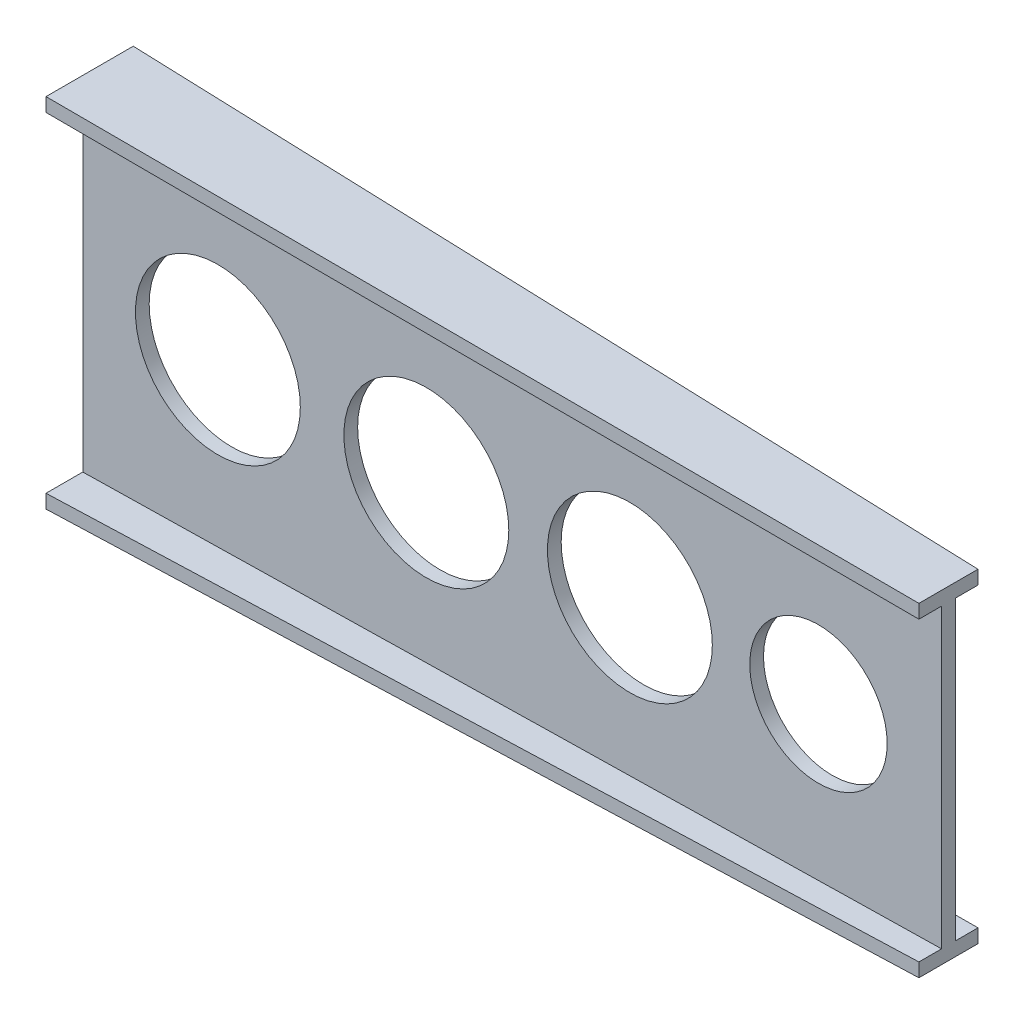
ISO-10303-21;
HEADER;
FILE_DESCRIPTION(('STEP AP214'),'2;1');
FILE_NAME('part.step','',(''),(''),'','','');
FILE_SCHEMA(('AUTOMOTIVE_DESIGN { 1 0 10303 214 1 1 1 1 }'));
ENDSEC;
DATA;
#1=APPLICATION_CONTEXT('core data for automotive mechanical design processes');
#2=APPLICATION_PROTOCOL_DEFINITION('international standard','automotive_design',2000,#1);
#3=PRODUCT_CONTEXT('',#1,'mechanical');
#4=PRODUCT('Part','Part','',(#3));
#5=PRODUCT_RELATED_PRODUCT_CATEGORY('part','',(#4));
#6=PRODUCT_DEFINITION_FORMATION('','',#4);
#7=PRODUCT_DEFINITION_CONTEXT('part definition',#1,'design');
#8=PRODUCT_DEFINITION('design','',#6,#7);
#9=PRODUCT_DEFINITION_SHAPE('','',#8);
#10=(LENGTH_UNIT() NAMED_UNIT(*) SI_UNIT(.MILLI.,.METRE.));
#11=(NAMED_UNIT(*) PLANE_ANGLE_UNIT() SI_UNIT($,.RADIAN.));
#12=(NAMED_UNIT(*) SI_UNIT($,.STERADIAN.) SOLID_ANGLE_UNIT());
#13=UNCERTAINTY_MEASURE_WITH_UNIT(LENGTH_MEASURE(1.E-05),#10,'distance_accuracy_value','');
#14=(GEOMETRIC_REPRESENTATION_CONTEXT(3) GLOBAL_UNCERTAINTY_ASSIGNED_CONTEXT((#13)) GLOBAL_UNIT_ASSIGNED_CONTEXT((#10,
#11,#12)) REPRESENTATION_CONTEXT('',''));
#15=CARTESIAN_POINT('',(0.,0.,0.));
#16=DIRECTION('',(0.,0.,1.));
#17=DIRECTION('',(1.,0.,0.));
#18=AXIS2_PLACEMENT_3D('',#15,#16,#17);
#19=CARTESIAN_POINT('',(1250.,0.,0.));
#20=DIRECTION('',(-1.,0.,0.));
#21=DIRECTION('',(0.,0.,1.));
#22=AXIS2_PLACEMENT_3D('',#19,#20,#21);
#23=PLANE('',#22);
#24=DIRECTION('',(0.,-1.,0.));
#25=VECTOR('',#24,1.);
#26=CARTESIAN_POINT('',(1250.,236.,-32.9999999999997));
#27=LINE('',#26,#25);
#28=CARTESIAN_POINT('',(1250.,236.,-32.9999999999997));
#29=VERTEX_POINT('',#28);
#30=CARTESIAN_POINT('',(1250.,216.,-32.9999999999997));
#31=VERTEX_POINT('',#30);
#32=EDGE_CURVE('E380',#29,#31,#27,.T.);
#33=ORIENTED_EDGE('',*,*,#32,.F.);
#34=DIRECTION('',(0.,0.,-1.));
#35=VECTOR('',#34,1.);
#36=CARTESIAN_POINT('',(1250.,236.,-32.9999999999997));
#37=LINE('',#36,#35);
#38=CARTESIAN_POINT('',(1250.,236.,53.0000000000004));
#39=VERTEX_POINT('',#38);
#40=EDGE_CURVE('E12',#39,#29,#37,.T.);
#41=ORIENTED_EDGE('',*,*,#40,.F.);
#42=DIRECTION('',(0.,1.,0.));
#43=VECTOR('',#42,1.);
#44=CARTESIAN_POINT('',(1250.,236.,53.0000000000004));
#45=LINE('',#44,#43);
#46=CARTESIAN_POINT('',(1250.,216.,53.0000000000004));
#47=VERTEX_POINT('',#46);
#48=EDGE_CURVE('E70',#47,#39,#45,.T.);
#49=ORIENTED_EDGE('',*,*,#48,.F.);
#50=DIRECTION('',(0.,0.,1.));
#51=VECTOR('',#50,1.);
#52=CARTESIAN_POINT('',(1250.,216.,20.0000000000002));
#53=LINE('',#52,#51);
#54=CARTESIAN_POINT('',(1250.,216.,20.0000000000002));
#55=VERTEX_POINT('',#54);
#56=EDGE_CURVE('E658',#55,#47,#53,.T.);
#57=ORIENTED_EDGE('',*,*,#56,.F.);
#58=DIRECTION('',(0.,1.,0.));
#59=VECTOR('',#58,1.);
#60=CARTESIAN_POINT('',(1250.,216.,20.0000000000002));
#61=LINE('',#60,#59);
#62=CARTESIAN_POINT('',(1250.,-216.,20.0000000000002));
#63=VERTEX_POINT('',#62);
#64=EDGE_CURVE('E417',#63,#55,#61,.T.);
#65=ORIENTED_EDGE('',*,*,#64,.F.);
#66=DIRECTION('',(0.,0.,-1.));
#67=VECTOR('',#66,1.);
#68=CARTESIAN_POINT('',(1250.,-216.,20.0000000000002));
#69=LINE('',#68,#67);
#70=CARTESIAN_POINT('',(1250.,-216.,53.0000000000002));
#71=VERTEX_POINT('',#70);
#72=EDGE_CURVE('E431',#71,#63,#69,.T.);
#73=ORIENTED_EDGE('',*,*,#72,.F.);
#74=DIRECTION('',(0.,1.,0.));
#75=VECTOR('',#74,1.);
#76=CARTESIAN_POINT('',(1250.,-216.,53.0000000000002));
#77=LINE('',#76,#75);
#78=CARTESIAN_POINT('',(1250.,-236.,53.0000000000004));
#79=VERTEX_POINT('',#78);
#80=EDGE_CURVE('E445',#79,#71,#77,.T.);
#81=ORIENTED_EDGE('',*,*,#80,.F.);
#82=DIRECTION('',(0.,0.,1.));
#83=VECTOR('',#82,1.);
#84=CARTESIAN_POINT('',(1250.,-236.,-32.9999999999997));
#85=LINE('',#84,#83);
#86=CARTESIAN_POINT('',(1250.,-236.,-32.9999999999997));
#87=VERTEX_POINT('',#86);
#88=EDGE_CURVE('E629',#87,#79,#85,.T.);
#89=ORIENTED_EDGE('',*,*,#88,.F.);
#90=DIRECTION('',(0.,-1.,0.));
#91=VECTOR('',#90,1.);
#92=CARTESIAN_POINT('',(1250.,-216.,-32.9999999999997));
#93=LINE('',#92,#91);
#94=CARTESIAN_POINT('',(1250.,-216.,-32.9999999999997));
#95=VERTEX_POINT('',#94);
#96=EDGE_CURVE('E621',#95,#87,#93,.T.);
#97=ORIENTED_EDGE('',*,*,#96,.F.);
#98=DIRECTION('',(0.,0.,-1.));
#99=VECTOR('',#98,1.);
#100=CARTESIAN_POINT('',(1250.,-216.,-32.9999999999997));
#101=LINE('',#100,#99);
#102=CARTESIAN_POINT('',(1250.,-216.,2.22044604925031E-13));
#103=VERTEX_POINT('',#102);
#104=EDGE_CURVE('E533',#103,#95,#101,.T.);
#105=ORIENTED_EDGE('',*,*,#104,.F.);
#106=DIRECTION('',(0.,-1.,0.));
#107=VECTOR('',#106,1.);
#108=CARTESIAN_POINT('',(1250.,216.,2.22044604925031E-13));
#109=LINE('',#108,#107);
#110=CARTESIAN_POINT('',(1250.,216.,2.22044604925031E-13));
#111=VERTEX_POINT('',#110);
#112=EDGE_CURVE('E84',#111,#103,#109,.T.);
#113=ORIENTED_EDGE('',*,*,#112,.F.);
#114=DIRECTION('',(0.,0.,1.));
#115=VECTOR('',#114,1.);
#116=CARTESIAN_POINT('',(1250.,216.,-32.9999999999997));
#117=LINE('',#116,#115);
#118=EDGE_CURVE('E78',#31,#111,#117,.T.);
#119=ORIENTED_EDGE('',*,*,#118,.F.);
#120=EDGE_LOOP('',(#33,#41,#49,#57,#65,#73,#81,#89,#97,#105,#113,#119));
#121=FACE_BOUND('',#120,.T.);
#122=ADVANCED_FACE('F61',(#121),#23,.F.);
#123=CARTESIAN_POINT('',(0.,0.,0.));
#124=DIRECTION('',(1.,0.,0.));
#125=DIRECTION('',(0.,0.,-1.));
#126=AXIS2_PLACEMENT_3D('',#123,#124,#125);
#127=PLANE('',#126);
#128=DIRECTION('',(0.,-1.,0.));
#129=VECTOR('',#128,1.);
#130=CARTESIAN_POINT('',(0.,260.,73.5000000000003));
#131=LINE('',#130,#129);
#132=CARTESIAN_POINT('',(0.,260.,73.5000000000003));
#133=VERTEX_POINT('',#132);
#134=CARTESIAN_POINT('',(0.,240.,73.5000000000003));
#135=VERTEX_POINT('',#134);
#136=EDGE_CURVE('E159',#133,#135,#131,.T.);
#137=ORIENTED_EDGE('',*,*,#136,.F.);
#138=DIRECTION('',(0.,0.,1.));
#139=VECTOR('',#138,1.);
#140=CARTESIAN_POINT('',(0.,260.,73.5000000000003));
#141=LINE('',#140,#139);
#142=CARTESIAN_POINT('',(0.,260.,-53.4999999999997));
#143=VERTEX_POINT('',#142);
#144=EDGE_CURVE('E168',#143,#133,#141,.T.);
#145=ORIENTED_EDGE('',*,*,#144,.F.);
#146=DIRECTION('',(0.,1.,0.));
#147=VECTOR('',#146,1.);
#148=CARTESIAN_POINT('',(0.,260.,-53.4999999999997));
#149=LINE('',#148,#147);
#150=CARTESIAN_POINT('',(0.,240.,-53.4999999999997));
#151=VERTEX_POINT('',#150);
#152=EDGE_CURVE('E175',#151,#143,#149,.T.);
#153=ORIENTED_EDGE('',*,*,#152,.F.);
#154=DIRECTION('',(0.,0.,-1.));
#155=VECTOR('',#154,1.);
#156=CARTESIAN_POINT('',(0.,240.,2.53624902133429E-13));
#157=LINE('',#156,#155);
#158=CARTESIAN_POINT('',(0.,240.,2.53624902133429E-13));
#159=VERTEX_POINT('',#158);
#160=EDGE_CURVE('E303',#159,#151,#157,.T.);
#161=ORIENTED_EDGE('',*,*,#160,.F.);
#162=DIRECTION('',(0.,1.,0.));
#163=VECTOR('',#162,1.);
#164=CARTESIAN_POINT('',(0.,240.,2.53624902133429E-13));
#165=LINE('',#164,#163);
#166=CARTESIAN_POINT('',(0.,-240.,2.53624902133429E-13));
#167=VERTEX_POINT('',#166);
#168=EDGE_CURVE('E299',#167,#159,#165,.T.);
#169=ORIENTED_EDGE('',*,*,#168,.F.);
#170=DIRECTION('',(0.,0.,1.));
#171=VECTOR('',#170,1.);
#172=CARTESIAN_POINT('',(0.,-240.,2.53624902133429E-13));
#173=LINE('',#172,#171);
#174=CARTESIAN_POINT('',(0.,-240.,-53.4999999999999));
#175=VERTEX_POINT('',#174);
#176=EDGE_CURVE('E295',#175,#167,#173,.T.);
#177=ORIENTED_EDGE('',*,*,#176,.F.);
#178=DIRECTION('',(0.,1.,0.));
#179=VECTOR('',#178,1.);
#180=CARTESIAN_POINT('',(0.,-240.,-53.4999999999999));
#181=LINE('',#180,#179);
#182=CARTESIAN_POINT('',(0.,-260.,-53.4999999999999));
#183=VERTEX_POINT('',#182);
#184=EDGE_CURVE('E291',#183,#175,#181,.T.);
#185=ORIENTED_EDGE('',*,*,#184,.F.);
#186=DIRECTION('',(0.,0.,-1.));
#187=VECTOR('',#186,1.);
#188=CARTESIAN_POINT('',(0.,-260.,73.5000000000001));
#189=LINE('',#188,#187);
#190=CARTESIAN_POINT('',(0.,-260.,73.5000000000001));
#191=VERTEX_POINT('',#190);
#192=EDGE_CURVE('E287',#191,#183,#189,.T.);
#193=ORIENTED_EDGE('',*,*,#192,.F.);
#194=DIRECTION('',(0.,-1.,0.));
#195=VECTOR('',#194,1.);
#196=CARTESIAN_POINT('',(0.,-240.,73.5000000000001));
#197=LINE('',#196,#195);
#198=CARTESIAN_POINT('',(0.,-240.,73.5000000000001));
#199=VERTEX_POINT('',#198);
#200=EDGE_CURVE('E283',#199,#191,#197,.T.);
#201=ORIENTED_EDGE('',*,*,#200,.F.);
#202=DIRECTION('',(0.,0.,1.));
#203=VECTOR('',#202,1.);
#204=CARTESIAN_POINT('',(0.,-240.,73.5000000000001));
#205=LINE('',#204,#203);
#206=CARTESIAN_POINT('',(0.,-240.,20.0000000000003));
#207=VERTEX_POINT('',#206);
#208=EDGE_CURVE('E278',#207,#199,#205,.T.);
#209=ORIENTED_EDGE('',*,*,#208,.F.);
#210=DIRECTION('',(0.,-1.,0.));
#211=VECTOR('',#210,1.);
#212=CARTESIAN_POINT('',(0.,240.,20.0000000000003));
#213=LINE('',#212,#211);
#214=CARTESIAN_POINT('',(0.,240.,20.0000000000003));
#215=VERTEX_POINT('',#214);
#216=EDGE_CURVE('E276',#215,#207,#213,.T.);
#217=ORIENTED_EDGE('',*,*,#216,.F.);
#218=DIRECTION('',(0.,0.,-1.));
#219=VECTOR('',#218,1.);
#220=CARTESIAN_POINT('',(0.,240.,73.5000000000003));
#221=LINE('',#220,#219);
#222=EDGE_CURVE('E182',#135,#215,#221,.T.);
#223=ORIENTED_EDGE('',*,*,#222,.F.);
#224=EDGE_LOOP('',(#137,#145,#153,#161,#169,#177,#185,#193,#201,#209,#217,#223));
#225=FACE_BOUND('',#224,.T.);
#226=ADVANCED_FACE('F180',(#225),#127,.F.);
#227=CARTESIAN_POINT('',(0.,0.,20.0000000000003));
#228=DIRECTION('',(0.,0.,1.));
#229=DIRECTION('',(1.,0.,0.));
#230=AXIS2_PLACEMENT_3D('',#227,#228,#229);
#231=PLANE('',#230);
#232=CARTESIAN_POINT('',(196.664397563097,0.,20.0000000000003));
#233=DIRECTION('',(0.,0.,1.));
#234=DIRECTION('',(1.,0.,0.));
#235=AXIS2_PLACEMENT_3D('',#232,#233,#234);
#236=CIRCLE('',#235,120.);
#237=CARTESIAN_POINT('',(316.664397563097,0.,20.0000000000003));
#238=VERTEX_POINT('',#237);
#239=EDGE_CURVE('E824',#238,#238,#236,.T.);
#240=ORIENTED_EDGE('',*,*,#239,.F.);
#241=EDGE_LOOP('',(#240));
#242=FACE_BOUND('',#241,.T.);
#243=CARTESIAN_POINT('',(500.077852957475,-3.28415443412666,20.0000000000003));
#244=DIRECTION('',(0.,0.,1.));
#245=DIRECTION('',(1.,0.,0.));
#246=AXIS2_PLACEMENT_3D('',#243,#244,#245);
#247=CIRCLE('',#246,120.);
#248=CARTESIAN_POINT('',(620.077852957475,-3.28415443412666,20.0000000000003));
#249=VERTEX_POINT('',#248);
#250=EDGE_CURVE('E826',#249,#249,#247,.T.);
#251=ORIENTED_EDGE('',*,*,#250,.F.);
#252=EDGE_LOOP('',(#251));
#253=FACE_BOUND('',#252,.T.);
#254=CARTESIAN_POINT('',(796.328764429859,0.,20.0000000000003));
#255=DIRECTION('',(0.,0.,1.));
#256=DIRECTION('',(1.,0.,0.));
#257=AXIS2_PLACEMENT_3D('',#254,#255,#256);
#258=CIRCLE('',#257,120.);
#259=CARTESIAN_POINT('',(916.328764429859,0.,20.0000000000003));
#260=VERTEX_POINT('',#259);
#261=EDGE_CURVE('E832',#260,#260,#258,.T.);
#262=ORIENTED_EDGE('',*,*,#261,.F.);
#263=EDGE_LOOP('',(#262));
#264=FACE_BOUND('',#263,.T.);
#265=CARTESIAN_POINT('',(1070.80650503423,2.99883157566683,20.0000000000003));
#266=DIRECTION('',(0.,0.,1.));
#267=DIRECTION('',(1.,0.,0.));
#268=AXIS2_PLACEMENT_3D('',#265,#266,#267);
#269=CIRCLE('',#268,100.);
#270=CARTESIAN_POINT('',(1170.80650503423,2.99883157566683,20.0000000000003));
#271=VERTEX_POINT('',#270);
#272=EDGE_CURVE('E836',#271,#271,#269,.T.);
#273=ORIENTED_EDGE('',*,*,#272,.F.);
#274=EDGE_LOOP('',(#273));
#275=FACE_BOUND('',#274,.T.);
#276=DIRECTION('',(0.999815730945143,0.0191964620341467,0.));
#277=VECTOR('',#276,1.);
#278=CARTESIAN_POINT('',(0.,-240.,20.0000000000003));
#279=LINE('',#278,#277);
#280=EDGE_CURVE('E174',#207,#63,#279,.T.);
#281=ORIENTED_EDGE('',*,*,#280,.T.);
#282=ORIENTED_EDGE('',*,*,#64,.T.);
#283=DIRECTION('',(0.999815730945143,-0.0191964620341467,0.));
#284=VECTOR('',#283,1.);
#285=CARTESIAN_POINT('',(0.,240.,20.0000000000003));
#286=LINE('',#285,#284);
#287=EDGE_CURVE('E390',#215,#55,#286,.T.);
#288=ORIENTED_EDGE('',*,*,#287,.F.);
#289=ORIENTED_EDGE('',*,*,#216,.T.);
#290=EDGE_LOOP('',(#281,#282,#288,#289));
#291=FACE_BOUND('',#290,.T.);
#292=ADVANCED_FACE('F204',(#242,#253,#264,#275,#291),#231,.T.);
#293=CARTESIAN_POINT('',(4.60630193285547,239.911559002889,0.));
#294=DIRECTION('',(-0.0191964620341468,-0.999815730945144,0.));
#295=DIRECTION('',(0.999815730945143,-0.0191964620341467,0.));
#296=AXIS2_PLACEMENT_3D('',#293,#294,#295);
#297=PLANE('',#296);
#298=ORIENTED_EDGE('',*,*,#287,.T.);
#299=ORIENTED_EDGE('',*,*,#56,.T.);
#300=DIRECTION('',(0.999681352369203,-0.0191938819654887,-0.0163947741788548));
#301=VECTOR('',#300,1.);
#302=CARTESIAN_POINT('',(0.,240.,73.5000000000003));
#303=LINE('',#302,#301);
#304=EDGE_CURVE('E164',#135,#47,#303,.T.);
#305=ORIENTED_EDGE('',*,*,#304,.F.);
#306=ORIENTED_EDGE('',*,*,#222,.T.);
#307=EDGE_LOOP('',(#298,#299,#305,#306));
#308=FACE_BOUND('',#307,.T.);
#309=ADVANCED_FACE('F392',(#308),#297,.T.);
#310=CARTESIAN_POINT('',(4.60630193285547,-239.911559002889,0.));
#311=DIRECTION('',(-0.0191964620341468,0.999815730945144,0.));
#312=DIRECTION('',(-0.999815730945144,-0.0191964620341468,0.));
#313=AXIS2_PLACEMENT_3D('',#310,#311,#312);
#314=PLANE('',#313);
#315=DIRECTION('',(0.999681352369203,0.0191938819654887,-0.0163947741788549));
#316=VECTOR('',#315,1.);
#317=CARTESIAN_POINT('',(0.,-240.,73.5000000000001));
#318=LINE('',#317,#316);
#319=EDGE_CURVE('E478',#199,#71,#318,.T.);
#320=ORIENTED_EDGE('',*,*,#319,.T.);
#321=ORIENTED_EDGE('',*,*,#72,.T.);
#322=ORIENTED_EDGE('',*,*,#280,.F.);
#323=ORIENTED_EDGE('',*,*,#208,.T.);
#324=EDGE_LOOP('',(#320,#321,#322,#323));
#325=FACE_BOUND('',#324,.T.);
#326=ADVANCED_FACE('F401',(#325),#314,.T.);
#327=CARTESIAN_POINT('',(1.20507588279049,8.15794507008855E-13,73.4802367555195));
#328=DIRECTION('',(0.0163977949727877,0.,0.999865547121227));
#329=DIRECTION('',(0.999865547121227,0.,-0.0163977949727877));
#330=AXIS2_PLACEMENT_3D('',#327,#328,#329);
#331=PLANE('',#330);
#332=DIRECTION('',(0.999681352369203,0.0191938819654887,-0.0163947741788547));
#333=VECTOR('',#332,1.);
#334=CARTESIAN_POINT('',(0.,-260.,73.5000000000001));
#335=LINE('',#334,#333);
#336=EDGE_CURVE('E470',#191,#79,#335,.T.);
#337=ORIENTED_EDGE('',*,*,#336,.T.);
#338=ORIENTED_EDGE('',*,*,#80,.T.);
#339=ORIENTED_EDGE('',*,*,#319,.F.);
#340=ORIENTED_EDGE('',*,*,#200,.T.);
#341=EDGE_LOOP('',(#337,#338,#339,#340));
#342=FACE_BOUND('',#341,.T.);
#343=ADVANCED_FACE('F451',(#342),#331,.T.);
#344=CARTESIAN_POINT('',(4.9901604272601,-259.904188919797,0.));
#345=DIRECTION('',(0.0191964620341468,-0.999815730945144,0.));
#346=DIRECTION('',(0.999815730945144,0.0191964620341468,0.));
#347=AXIS2_PLACEMENT_3D('',#344,#345,#346);
#348=PLANE('',#347);
#349=DIRECTION('',(0.999681352369203,0.0191938819654887,0.0163947741788551));
#350=VECTOR('',#349,1.);
#351=CARTESIAN_POINT('',(0.,-260.,-53.4999999999999));
#352=LINE('',#351,#350);
#353=EDGE_CURVE('E477',#183,#87,#352,.T.);
#354=ORIENTED_EDGE('',*,*,#353,.T.);
#355=ORIENTED_EDGE('',*,*,#88,.T.);
#356=ORIENTED_EDGE('',*,*,#336,.F.);
#357=ORIENTED_EDGE('',*,*,#192,.T.);
#358=EDGE_LOOP('',(#354,#355,#356,#357));
#359=FACE_BOUND('',#358,.T.);
#360=ADVANCED_FACE('F460',(#359),#348,.T.);
#361=CARTESIAN_POINT('',(0.8771640779496,0.,-53.4856145091215));
#362=DIRECTION('',(0.0163977949727883,0.,-0.999865547121227));
#363=DIRECTION('',(-0.999865547121227,0.,-0.0163977949727883));
#364=AXIS2_PLACEMENT_3D('',#361,#362,#363);
#365=PLANE('',#364);
#366=DIRECTION('',(0.999681352369203,0.0191938819654887,0.0163947741788551));
#367=VECTOR('',#366,1.);
#368=CARTESIAN_POINT('',(0.,-240.,-53.4999999999999));
#369=LINE('',#368,#367);
#370=EDGE_CURVE('E495',#175,#95,#369,.T.);
#371=ORIENTED_EDGE('',*,*,#370,.T.);
#372=ORIENTED_EDGE('',*,*,#96,.T.);
#373=ORIENTED_EDGE('',*,*,#353,.F.);
#374=ORIENTED_EDGE('',*,*,#184,.T.);
#375=EDGE_LOOP('',(#371,#372,#373,#374));
#376=FACE_BOUND('',#375,.T.);
#377=ADVANCED_FACE('F506',(#376),#365,.T.);
#378=CARTESIAN_POINT('',(4.60630193285547,-239.911559002889,0.));
#379=DIRECTION('',(-0.0191964620341468,0.999815730945144,0.));
#380=DIRECTION('',(-0.999815730945143,-0.0191964620341467,0.));
#381=AXIS2_PLACEMENT_3D('',#378,#379,#380);
#382=PLANE('',#381);
#383=DIRECTION('',(0.999815730945143,0.0191964620341467,0.));
#384=VECTOR('',#383,1.);
#385=CARTESIAN_POINT('',(0.,-240.,2.53624902133429E-13));
#386=LINE('',#385,#384);
#387=EDGE_CURVE('E573',#167,#103,#386,.T.);
#388=ORIENTED_EDGE('',*,*,#387,.T.);
#389=ORIENTED_EDGE('',*,*,#104,.T.);
#390=ORIENTED_EDGE('',*,*,#370,.F.);
#391=ORIENTED_EDGE('',*,*,#176,.T.);
#392=EDGE_LOOP('',(#388,#389,#390,#391));
#393=FACE_BOUND('',#392,.T.);
#394=ADVANCED_FACE('F515',(#393),#382,.T.);
#395=CARTESIAN_POINT('',(0.,0.,2.53624902133429E-13));
#396=DIRECTION('',(0.,0.,-1.));
#397=DIRECTION('',(-1.,0.,0.));
#398=AXIS2_PLACEMENT_3D('',#395,#396,#397);
#399=PLANE('',#398);
#400=CARTESIAN_POINT('',(196.664397563097,0.,2.4980018054066E-13));
#401=DIRECTION('',(0.,0.,-1.));
#402=DIRECTION('',(-1.,0.,0.));
#403=AXIS2_PLACEMENT_3D('',#400,#401,#402);
#404=CIRCLE('',#403,120.);
#405=CARTESIAN_POINT('',(76.6643975630973,0.,2.52831889072666E-13));
#406=VERTEX_POINT('',#405);
#407=EDGE_CURVE('E65',#406,#406,#404,.T.);
#408=ORIENTED_EDGE('',*,*,#407,.F.);
#409=EDGE_LOOP('',(#408));
#410=FACE_BOUND('',#409,.T.);
#411=CARTESIAN_POINT('',(500.077852957475,-3.28415443412666,2.42861286636753E-13));
#412=DIRECTION('',(0.,0.,-1.));
#413=DIRECTION('',(-1.,0.,0.));
#414=AXIS2_PLACEMENT_3D('',#411,#412,#413);
#415=CIRCLE('',#414,120.);
#416=CARTESIAN_POINT('',(380.077852957475,-3.28415443412666,2.45892995168759E-13));
#417=VERTEX_POINT('',#416);
#418=EDGE_CURVE('E849',#417,#417,#415,.T.);
#419=ORIENTED_EDGE('',*,*,#418,.F.);
#420=EDGE_LOOP('',(#419));
#421=FACE_BOUND('',#420,.T.);
#422=CARTESIAN_POINT('',(796.328764429859,0.,2.35922392732846E-13));
#423=DIRECTION('',(0.,0.,-1.));
#424=DIRECTION('',(-1.,0.,0.));
#425=AXIS2_PLACEMENT_3D('',#422,#423,#424);
#426=CIRCLE('',#425,120.);
#427=CARTESIAN_POINT('',(676.328764429859,0.,2.38954101264852E-13));
#428=VERTEX_POINT('',#427);
#429=EDGE_CURVE('E829',#428,#428,#426,.T.);
#430=ORIENTED_EDGE('',*,*,#429,.F.);
#431=EDGE_LOOP('',(#430));
#432=FACE_BOUND('',#431,.T.);
#433=CARTESIAN_POINT('',(1070.80650503423,2.99883157566683,2.28983498828939E-13));
#434=DIRECTION('',(0.,0.,-1.));
#435=DIRECTION('',(-1.,0.,0.));
#436=AXIS2_PLACEMENT_3D('',#433,#434,#435);
#437=CIRCLE('',#436,100.);
#438=CARTESIAN_POINT('',(970.806505034227,2.99883157566683,2.3150992260561E-13));
#439=VERTEX_POINT('',#438);
#440=EDGE_CURVE('E825',#439,#439,#437,.T.);
#441=ORIENTED_EDGE('',*,*,#440,.F.);
#442=EDGE_LOOP('',(#441));
#443=FACE_BOUND('',#442,.T.);
#444=DIRECTION('',(0.999815730945143,-0.0191964620341467,0.));
#445=VECTOR('',#444,1.);
#446=CARTESIAN_POINT('',(0.,240.,2.53624902133429E-13));
#447=LINE('',#446,#445);
#448=EDGE_CURVE('E565',#159,#111,#447,.T.);
#449=ORIENTED_EDGE('',*,*,#448,.T.);
#450=ORIENTED_EDGE('',*,*,#112,.T.);
#451=ORIENTED_EDGE('',*,*,#387,.F.);
#452=ORIENTED_EDGE('',*,*,#168,.T.);
#453=EDGE_LOOP('',(#449,#450,#451,#452));
#454=FACE_BOUND('',#453,.T.);
#455=ADVANCED_FACE('F549',(#410,#421,#432,#443,#454),#399,.T.);
#456=CARTESIAN_POINT('',(4.60630193285548,239.911559002889,0.));
#457=DIRECTION('',(-0.0191964620341468,-0.999815730945144,0.));
#458=DIRECTION('',(0.999815730945144,-0.0191964620341468,0.));
#459=AXIS2_PLACEMENT_3D('',#456,#457,#458);
#460=PLANE('',#459);
#461=DIRECTION('',(0.999681352369203,-0.0191938819654887,0.016394774178855));
#462=VECTOR('',#461,1.);
#463=CARTESIAN_POINT('',(0.,240.,-53.4999999999997));
#464=LINE('',#463,#462);
#465=EDGE_CURVE('E572',#151,#31,#464,.T.);
#466=ORIENTED_EDGE('',*,*,#465,.T.);
#467=ORIENTED_EDGE('',*,*,#118,.T.);
#468=ORIENTED_EDGE('',*,*,#448,.F.);
#469=ORIENTED_EDGE('',*,*,#160,.T.);
#470=EDGE_LOOP('',(#466,#467,#468,#469));
#471=FACE_BOUND('',#470,.T.);
#472=ADVANCED_FACE('F330',(#471),#460,.T.);
#473=CARTESIAN_POINT('',(0.877164077949592,0.,-53.4856145091213));
#474=DIRECTION('',(0.0163977949727881,0.,-0.999865547121227));
#475=DIRECTION('',(-0.999865547121227,0.,-0.0163977949727881));
#476=AXIS2_PLACEMENT_3D('',#473,#474,#475);
#477=PLANE('',#476);
#478=DIRECTION('',(0.999681352369203,-0.0191938819654888,0.016394774178855));
#479=VECTOR('',#478,1.);
#480=CARTESIAN_POINT('',(0.,260.,-53.4999999999997));
#481=LINE('',#480,#479);
#482=EDGE_CURVE('E165',#143,#29,#481,.T.);
#483=ORIENTED_EDGE('',*,*,#482,.T.);
#484=ORIENTED_EDGE('',*,*,#32,.T.);
#485=ORIENTED_EDGE('',*,*,#465,.F.);
#486=ORIENTED_EDGE('',*,*,#152,.T.);
#487=EDGE_LOOP('',(#483,#484,#485,#486));
#488=FACE_BOUND('',#487,.T.);
#489=ADVANCED_FACE('F320',(#488),#477,.T.);
#490=CARTESIAN_POINT('',(4.9901604272601,259.904188919797,0.));
#491=DIRECTION('',(0.0191964620341468,0.999815730945144,0.));
#492=DIRECTION('',(-0.999815730945144,0.0191964620341468,0.));
#493=AXIS2_PLACEMENT_3D('',#490,#491,#492);
#494=PLANE('',#493);
#495=DIRECTION('',(0.999681352369203,-0.0191938819654887,-0.0163947741788548));
#496=VECTOR('',#495,1.);
#497=CARTESIAN_POINT('',(0.,260.,73.5000000000003));
#498=LINE('',#497,#496);
#499=EDGE_CURVE('E154',#133,#39,#498,.T.);
#500=ORIENTED_EDGE('',*,*,#499,.T.);
#501=ORIENTED_EDGE('',*,*,#40,.T.);
#502=ORIENTED_EDGE('',*,*,#482,.F.);
#503=ORIENTED_EDGE('',*,*,#144,.T.);
#504=EDGE_LOOP('',(#500,#501,#502,#503));
#505=FACE_BOUND('',#504,.T.);
#506=ADVANCED_FACE('F170',(#505),#494,.T.);
#507=CARTESIAN_POINT('',(1.20507588279056,0.,73.4802367555225));
#508=DIRECTION('',(0.016397794972788,0.,0.999865547121227));
#509=DIRECTION('',(0.999865547121227,0.,-0.016397794972788));
#510=AXIS2_PLACEMENT_3D('',#507,#508,#509);
#511=PLANE('',#510);
#512=ORIENTED_EDGE('',*,*,#304,.T.);
#513=ORIENTED_EDGE('',*,*,#48,.T.);
#514=ORIENTED_EDGE('',*,*,#499,.F.);
#515=ORIENTED_EDGE('',*,*,#136,.T.);
#516=EDGE_LOOP('',(#512,#513,#514,#515));
#517=FACE_BOUND('',#516,.T.);
#518=ADVANCED_FACE('F157',(#517),#511,.T.);
#519=CARTESIAN_POINT('',(1070.80650503423,2.99883157566683,-53.5000999999999));
#520=DIRECTION('',(0.,0.,1.));
#521=DIRECTION('',(1.,0.,0.));
#522=AXIS2_PLACEMENT_3D('',#519,#520,#521);
#523=CYLINDRICAL_SURFACE('',#522,100.);
#524=ORIENTED_EDGE('',*,*,#440,.T.);
#525=EDGE_LOOP('',(#524));
#526=FACE_BOUND('',#525,.T.);
#527=ORIENTED_EDGE('',*,*,#272,.T.);
#528=EDGE_LOOP('',(#527));
#529=FACE_BOUND('',#528,.T.);
#530=ADVANCED_FACE('F205',(#526,#529),#523,.F.);
#531=CARTESIAN_POINT('',(796.328764429859,0.,-53.5000999999999));
#532=DIRECTION('',(0.,0.,1.));
#533=DIRECTION('',(1.,0.,0.));
#534=AXIS2_PLACEMENT_3D('',#531,#532,#533);
#535=CYLINDRICAL_SURFACE('',#534,120.);
#536=ORIENTED_EDGE('',*,*,#429,.T.);
#537=EDGE_LOOP('',(#536));
#538=FACE_BOUND('',#537,.T.);
#539=ORIENTED_EDGE('',*,*,#261,.T.);
#540=EDGE_LOOP('',(#539));
#541=FACE_BOUND('',#540,.T.);
#542=ADVANCED_FACE('F787',(#538,#541),#535,.F.);
#543=CARTESIAN_POINT('',(500.077852957475,-3.28415443412666,-53.5000999999999));
#544=DIRECTION('',(0.,0.,1.));
#545=DIRECTION('',(1.,0.,0.));
#546=AXIS2_PLACEMENT_3D('',#543,#544,#545);
#547=CYLINDRICAL_SURFACE('',#546,120.);
#548=ORIENTED_EDGE('',*,*,#418,.T.);
#549=EDGE_LOOP('',(#548));
#550=FACE_BOUND('',#549,.T.);
#551=ORIENTED_EDGE('',*,*,#250,.T.);
#552=EDGE_LOOP('',(#551));
#553=FACE_BOUND('',#552,.T.);
#554=ADVANCED_FACE('F793',(#550,#553),#547,.F.);
#555=CARTESIAN_POINT('',(196.664397563097,0.,-53.5000999999999));
#556=DIRECTION('',(0.,0.,1.));
#557=DIRECTION('',(1.,0.,0.));
#558=AXIS2_PLACEMENT_3D('',#555,#556,#557);
#559=CYLINDRICAL_SURFACE('',#558,120.);
#560=ORIENTED_EDGE('',*,*,#407,.T.);
#561=EDGE_LOOP('',(#560));
#562=FACE_BOUND('',#561,.T.);
#563=ORIENTED_EDGE('',*,*,#239,.T.);
#564=EDGE_LOOP('',(#563));
#565=FACE_BOUND('',#564,.T.);
#566=ADVANCED_FACE('F800',(#562,#565),#559,.F.);
#567=CLOSED_SHELL('',(#122,#226,#292,#309,#326,#343,#360,#377,#394,#455,#472,#489,#506,#518,
#530,#542,#554,#566));
#568=MANIFOLD_SOLID_BREP('B2',#567);
#569=ADVANCED_BREP_SHAPE_REPRESENTATION('',(#18,#568),#14);
#570=SHAPE_DEFINITION_REPRESENTATION(#9,#569);
ENDSEC;
END-ISO-10303-21;
